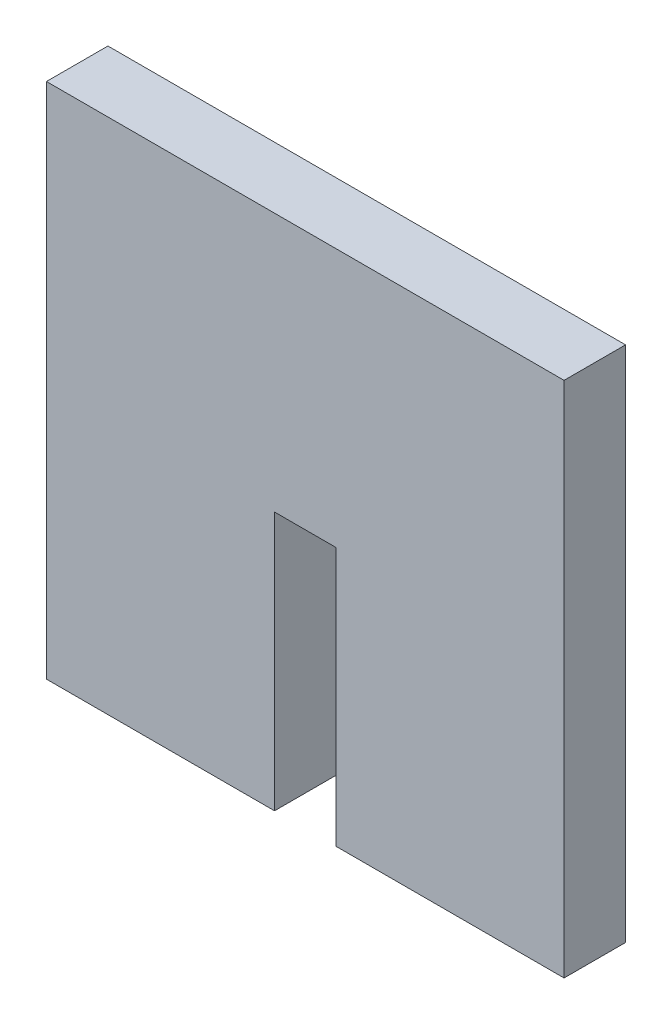
ISO-10303-21;
HEADER;
FILE_DESCRIPTION(('STEP AP214'),'2;1');
FILE_NAME('part.step','',(''),(''),'','','');
FILE_SCHEMA(('AUTOMOTIVE_DESIGN { 1 0 10303 214 1 1 1 1 }'));
ENDSEC;
DATA;
#1=APPLICATION_CONTEXT('core data for automotive mechanical design processes');
#2=APPLICATION_PROTOCOL_DEFINITION('international standard','automotive_design',2000,#1);
#3=PRODUCT_CONTEXT('',#1,'mechanical');
#4=PRODUCT('Part','Part','',(#3));
#5=PRODUCT_RELATED_PRODUCT_CATEGORY('part','',(#4));
#6=PRODUCT_DEFINITION_FORMATION('','',#4);
#7=PRODUCT_DEFINITION_CONTEXT('part definition',#1,'design');
#8=PRODUCT_DEFINITION('design','',#6,#7);
#9=PRODUCT_DEFINITION_SHAPE('','',#8);
#10=(LENGTH_UNIT() NAMED_UNIT(*) SI_UNIT(.MILLI.,.METRE.));
#11=(NAMED_UNIT(*) PLANE_ANGLE_UNIT() SI_UNIT($,.RADIAN.));
#12=(NAMED_UNIT(*) SI_UNIT($,.STERADIAN.) SOLID_ANGLE_UNIT());
#13=UNCERTAINTY_MEASURE_WITH_UNIT(LENGTH_MEASURE(1.E-05),#10,'distance_accuracy_value','');
#14=(GEOMETRIC_REPRESENTATION_CONTEXT(3) GLOBAL_UNCERTAINTY_ASSIGNED_CONTEXT((#13)) GLOBAL_UNIT_ASSIGNED_CONTEXT((#10,
#11,#12)) REPRESENTATION_CONTEXT('',''));
#15=CARTESIAN_POINT('',(0.,0.,0.));
#16=DIRECTION('',(0.,0.,1.));
#17=DIRECTION('',(1.,0.,0.));
#18=AXIS2_PLACEMENT_3D('',#15,#16,#17);
#19=CARTESIAN_POINT('',(0.,0.,4.318));
#20=DIRECTION('',(1.,0.,0.));
#21=DIRECTION('',(0.,0.,-1.));
#22=AXIS2_PLACEMENT_3D('',#19,#20,#21);
#23=PLANE('',#22);
#24=DIRECTION('',(0.,-1.,0.));
#25=VECTOR('',#24,1.);
#26=CARTESIAN_POINT('',(0.,0.,0.));
#27=LINE('',#26,#25);
#28=CARTESIAN_POINT('',(0.,36.36,0.));
#29=VERTEX_POINT('',#28);
#30=CARTESIAN_POINT('',(0.,0.,0.));
#31=VERTEX_POINT('',#30);
#32=EDGE_CURVE('E129',#29,#31,#27,.T.);
#33=ORIENTED_EDGE('',*,*,#32,.T.);
#34=DIRECTION('',(0.,0.,-1.));
#35=VECTOR('',#34,1.);
#36=CARTESIAN_POINT('',(0.,0.,4.318));
#37=LINE('',#36,#35);
#38=CARTESIAN_POINT('',(0.,0.,4.318));
#39=VERTEX_POINT('',#38);
#40=EDGE_CURVE('E11',#39,#31,#37,.T.);
#41=ORIENTED_EDGE('',*,*,#40,.F.);
#42=DIRECTION('',(0.,-1.,0.));
#43=VECTOR('',#42,1.);
#44=CARTESIAN_POINT('',(0.,0.,4.318));
#45=LINE('',#44,#43);
#46=CARTESIAN_POINT('',(0.,36.36,4.318));
#47=VERTEX_POINT('',#46);
#48=EDGE_CURVE('E143',#47,#39,#45,.T.);
#49=ORIENTED_EDGE('',*,*,#48,.F.);
#50=DIRECTION('',(0.,0.,-1.));
#51=VECTOR('',#50,1.);
#52=CARTESIAN_POINT('',(0.,36.36,4.318));
#53=LINE('',#52,#51);
#54=EDGE_CURVE('E125',#47,#29,#53,.T.);
#55=ORIENTED_EDGE('',*,*,#54,.T.);
#56=EDGE_LOOP('',(#33,#41,#49,#55));
#57=FACE_BOUND('',#56,.T.);
#58=ADVANCED_FACE('F33',(#57),#23,.F.);
#59=CARTESIAN_POINT('',(0.,0.,4.318));
#60=DIRECTION('',(0.,1.,0.));
#61=DIRECTION('',(0.,0.,1.));
#62=AXIS2_PLACEMENT_3D('',#59,#60,#61);
#63=PLANE('',#62);
#64=DIRECTION('',(1.,0.,0.));
#65=VECTOR('',#64,1.);
#66=CARTESIAN_POINT('',(0.,0.,0.));
#67=LINE('',#66,#65);
#68=CARTESIAN_POINT('',(16.021,0.,0.));
#69=VERTEX_POINT('',#68);
#70=EDGE_CURVE('E132',#31,#69,#67,.T.);
#71=ORIENTED_EDGE('',*,*,#70,.T.);
#72=DIRECTION('',(0.,0.,-1.));
#73=VECTOR('',#72,1.);
#74=CARTESIAN_POINT('',(16.021,0.,4.318));
#75=LINE('',#74,#73);
#76=CARTESIAN_POINT('',(16.021,0.,4.318));
#77=VERTEX_POINT('',#76);
#78=EDGE_CURVE('E41',#77,#69,#75,.T.);
#79=ORIENTED_EDGE('',*,*,#78,.F.);
#80=DIRECTION('',(1.,0.,0.));
#81=VECTOR('',#80,1.);
#82=CARTESIAN_POINT('',(0.,0.,4.318));
#83=LINE('',#82,#81);
#84=EDGE_CURVE('E92',#39,#77,#83,.T.);
#85=ORIENTED_EDGE('',*,*,#84,.F.);
#86=ORIENTED_EDGE('',*,*,#40,.T.);
#87=EDGE_LOOP('',(#71,#79,#85,#86));
#88=FACE_BOUND('',#87,.T.);
#89=ADVANCED_FACE('F178',(#88),#63,.F.);
#90=CARTESIAN_POINT('',(16.021,0.,4.318));
#91=DIRECTION('',(-1.,0.,0.));
#92=DIRECTION('',(0.,-1.,0.));
#93=AXIS2_PLACEMENT_3D('',#90,#91,#92);
#94=PLANE('',#93);
#95=DIRECTION('',(0.,1.,0.));
#96=VECTOR('',#95,1.);
#97=CARTESIAN_POINT('',(16.021,0.,0.));
#98=LINE('',#97,#96);
#99=CARTESIAN_POINT('',(16.021,18.18,0.));
#100=VERTEX_POINT('',#99);
#101=EDGE_CURVE('E134',#69,#100,#98,.T.);
#102=ORIENTED_EDGE('',*,*,#101,.T.);
#103=DIRECTION('',(0.,0.,-1.));
#104=VECTOR('',#103,1.);
#105=CARTESIAN_POINT('',(16.021,18.18,4.318));
#106=LINE('',#105,#104);
#107=CARTESIAN_POINT('',(16.021,18.18,4.318));
#108=VERTEX_POINT('',#107);
#109=EDGE_CURVE('E150',#108,#100,#106,.T.);
#110=ORIENTED_EDGE('',*,*,#109,.F.);
#111=DIRECTION('',(0.,1.,0.));
#112=VECTOR('',#111,1.);
#113=CARTESIAN_POINT('',(16.021,0.,4.318));
#114=LINE('',#113,#112);
#115=EDGE_CURVE('E158',#77,#108,#114,.T.);
#116=ORIENTED_EDGE('',*,*,#115,.F.);
#117=ORIENTED_EDGE('',*,*,#78,.T.);
#118=EDGE_LOOP('',(#102,#110,#116,#117));
#119=FACE_BOUND('',#118,.T.);
#120=ADVANCED_FACE('F156',(#119),#94,.F.);
#121=CARTESIAN_POINT('',(16.021,18.18,4.318));
#122=DIRECTION('',(0.,1.,0.));
#123=DIRECTION('',(0.,0.,1.));
#124=AXIS2_PLACEMENT_3D('',#121,#122,#123);
#125=PLANE('',#124);
#126=DIRECTION('',(1.,0.,0.));
#127=VECTOR('',#126,1.);
#128=CARTESIAN_POINT('',(16.021,18.18,0.));
#129=LINE('',#128,#127);
#130=CARTESIAN_POINT('',(20.339,18.18,0.));
#131=VERTEX_POINT('',#130);
#132=EDGE_CURVE('E136',#100,#131,#129,.T.);
#133=ORIENTED_EDGE('',*,*,#132,.T.);
#134=DIRECTION('',(0.,0.,-1.));
#135=VECTOR('',#134,1.);
#136=CARTESIAN_POINT('',(20.339,18.18,4.318));
#137=LINE('',#136,#135);
#138=CARTESIAN_POINT('',(20.339,18.18,4.318));
#139=VERTEX_POINT('',#138);
#140=EDGE_CURVE('E147',#139,#131,#137,.T.);
#141=ORIENTED_EDGE('',*,*,#140,.F.);
#142=DIRECTION('',(1.,0.,0.));
#143=VECTOR('',#142,1.);
#144=CARTESIAN_POINT('',(16.021,18.18,4.318));
#145=LINE('',#144,#143);
#146=EDGE_CURVE('E170',#108,#139,#145,.T.);
#147=ORIENTED_EDGE('',*,*,#146,.F.);
#148=ORIENTED_EDGE('',*,*,#109,.T.);
#149=EDGE_LOOP('',(#133,#141,#147,#148));
#150=FACE_BOUND('',#149,.T.);
#151=ADVANCED_FACE('F166',(#150),#125,.F.);
#152=CARTESIAN_POINT('',(20.339,0.,4.318));
#153=DIRECTION('',(1.,0.,0.));
#154=DIRECTION('',(0.,0.,-1.));
#155=AXIS2_PLACEMENT_3D('',#152,#153,#154);
#156=PLANE('',#155);
#157=DIRECTION('',(0.,-1.,0.));
#158=VECTOR('',#157,1.);
#159=CARTESIAN_POINT('',(20.339,0.,0.));
#160=LINE('',#159,#158);
#161=CARTESIAN_POINT('',(20.339,0.,0.));
#162=VERTEX_POINT('',#161);
#163=EDGE_CURVE('E138',#131,#162,#160,.T.);
#164=ORIENTED_EDGE('',*,*,#163,.T.);
#165=DIRECTION('',(0.,0.,-1.));
#166=VECTOR('',#165,1.);
#167=CARTESIAN_POINT('',(20.339,0.,4.318));
#168=LINE('',#167,#166);
#169=CARTESIAN_POINT('',(20.339,0.,4.318));
#170=VERTEX_POINT('',#169);
#171=EDGE_CURVE('E120',#170,#162,#168,.T.);
#172=ORIENTED_EDGE('',*,*,#171,.F.);
#173=DIRECTION('',(0.,-1.,0.));
#174=VECTOR('',#173,1.);
#175=CARTESIAN_POINT('',(20.339,0.,4.318));
#176=LINE('',#175,#174);
#177=EDGE_CURVE('E111',#139,#170,#176,.T.);
#178=ORIENTED_EDGE('',*,*,#177,.F.);
#179=ORIENTED_EDGE('',*,*,#140,.T.);
#180=EDGE_LOOP('',(#164,#172,#178,#179));
#181=FACE_BOUND('',#180,.T.);
#182=ADVANCED_FACE('F169',(#181),#156,.F.);
#183=CARTESIAN_POINT('',(20.339,0.,4.318));
#184=DIRECTION('',(0.,1.,0.));
#185=DIRECTION('',(0.,0.,1.));
#186=AXIS2_PLACEMENT_3D('',#183,#184,#185);
#187=PLANE('',#186);
#188=DIRECTION('',(1.,0.,0.));
#189=VECTOR('',#188,1.);
#190=CARTESIAN_POINT('',(20.339,0.,0.));
#191=LINE('',#190,#189);
#192=CARTESIAN_POINT('',(36.36,0.,0.));
#193=VERTEX_POINT('',#192);
#194=EDGE_CURVE('E119',#162,#193,#191,.T.);
#195=ORIENTED_EDGE('',*,*,#194,.T.);
#196=DIRECTION('',(0.,0.,-1.));
#197=VECTOR('',#196,1.);
#198=CARTESIAN_POINT('',(36.36,0.,4.318));
#199=LINE('',#198,#197);
#200=CARTESIAN_POINT('',(36.36,0.,4.318));
#201=VERTEX_POINT('',#200);
#202=EDGE_CURVE('E116',#201,#193,#199,.T.);
#203=ORIENTED_EDGE('',*,*,#202,.F.);
#204=DIRECTION('',(1.,0.,0.));
#205=VECTOR('',#204,1.);
#206=CARTESIAN_POINT('',(20.339,0.,4.318));
#207=LINE('',#206,#205);
#208=EDGE_CURVE('E105',#170,#201,#207,.T.);
#209=ORIENTED_EDGE('',*,*,#208,.F.);
#210=ORIENTED_EDGE('',*,*,#171,.T.);
#211=EDGE_LOOP('',(#195,#203,#209,#210));
#212=FACE_BOUND('',#211,.T.);
#213=ADVANCED_FACE('F117',(#212),#187,.F.);
#214=CARTESIAN_POINT('',(36.36,0.,4.318));
#215=DIRECTION('',(-1.,0.,0.));
#216=DIRECTION('',(0.,0.,1.));
#217=AXIS2_PLACEMENT_3D('',#214,#215,#216);
#218=PLANE('',#217);
#219=DIRECTION('',(0.,1.,0.));
#220=VECTOR('',#219,1.);
#221=CARTESIAN_POINT('',(36.36,0.,0.));
#222=LINE('',#221,#220);
#223=CARTESIAN_POINT('',(36.36,36.36,0.));
#224=VERTEX_POINT('',#223);
#225=EDGE_CURVE('E78',#193,#224,#222,.T.);
#226=ORIENTED_EDGE('',*,*,#225,.T.);
#227=DIRECTION('',(0.,0.,-1.));
#228=VECTOR('',#227,1.);
#229=CARTESIAN_POINT('',(36.36,36.36,4.318));
#230=LINE('',#229,#228);
#231=CARTESIAN_POINT('',(36.36,36.36,4.318));
#232=VERTEX_POINT('',#231);
#233=EDGE_CURVE('E121',#232,#224,#230,.T.);
#234=ORIENTED_EDGE('',*,*,#233,.F.);
#235=DIRECTION('',(0.,1.,0.));
#236=VECTOR('',#235,1.);
#237=CARTESIAN_POINT('',(36.36,0.,4.318));
#238=LINE('',#237,#236);
#239=EDGE_CURVE('E109',#201,#232,#238,.T.);
#240=ORIENTED_EDGE('',*,*,#239,.F.);
#241=ORIENTED_EDGE('',*,*,#202,.T.);
#242=EDGE_LOOP('',(#226,#234,#240,#241));
#243=FACE_BOUND('',#242,.T.);
#244=ADVANCED_FACE('F123',(#243),#218,.F.);
#245=CARTESIAN_POINT('',(0.,36.36,4.318));
#246=DIRECTION('',(0.,-1.,0.));
#247=DIRECTION('',(0.,0.,-1.));
#248=AXIS2_PLACEMENT_3D('',#245,#246,#247);
#249=PLANE('',#248);
#250=DIRECTION('',(-1.,0.,0.));
#251=VECTOR('',#250,1.);
#252=CARTESIAN_POINT('',(0.,36.36,0.));
#253=LINE('',#252,#251);
#254=EDGE_CURVE('E84',#224,#29,#253,.T.);
#255=ORIENTED_EDGE('',*,*,#254,.T.);
#256=ORIENTED_EDGE('',*,*,#54,.F.);
#257=DIRECTION('',(-1.,0.,0.));
#258=VECTOR('',#257,1.);
#259=CARTESIAN_POINT('',(0.,36.36,4.318));
#260=LINE('',#259,#258);
#261=EDGE_CURVE('E49',#232,#47,#260,.T.);
#262=ORIENTED_EDGE('',*,*,#261,.F.);
#263=ORIENTED_EDGE('',*,*,#233,.T.);
#264=EDGE_LOOP('',(#255,#256,#262,#263));
#265=FACE_BOUND('',#264,.T.);
#266=ADVANCED_FACE('F194',(#265),#249,.F.);
#267=CARTESIAN_POINT('',(0.,36.36,4.318));
#268=DIRECTION('',(0.,0.,-1.));
#269=DIRECTION('',(-1.,0.,0.));
#270=AXIS2_PLACEMENT_3D('',#267,#268,#269);
#271=PLANE('',#270);
#272=ORIENTED_EDGE('',*,*,#48,.T.);
#273=ORIENTED_EDGE('',*,*,#84,.T.);
#274=ORIENTED_EDGE('',*,*,#115,.T.);
#275=ORIENTED_EDGE('',*,*,#146,.T.);
#276=ORIENTED_EDGE('',*,*,#177,.T.);
#277=ORIENTED_EDGE('',*,*,#208,.T.);
#278=ORIENTED_EDGE('',*,*,#239,.T.);
#279=ORIENTED_EDGE('',*,*,#261,.T.);
#280=EDGE_LOOP('',(#272,#273,#274,#275,#276,#277,#278,#279));
#281=FACE_BOUND('',#280,.T.);
#282=ADVANCED_FACE('F107',(#281),#271,.F.);
#283=CARTESIAN_POINT('',(0.,36.36,0.));
#284=DIRECTION('',(0.,0.,-1.));
#285=DIRECTION('',(-1.,0.,0.));
#286=AXIS2_PLACEMENT_3D('',#283,#284,#285);
#287=PLANE('',#286);
#288=ORIENTED_EDGE('',*,*,#32,.F.);
#289=ORIENTED_EDGE('',*,*,#254,.F.);
#290=ORIENTED_EDGE('',*,*,#225,.F.);
#291=ORIENTED_EDGE('',*,*,#194,.F.);
#292=ORIENTED_EDGE('',*,*,#163,.F.);
#293=ORIENTED_EDGE('',*,*,#132,.F.);
#294=ORIENTED_EDGE('',*,*,#101,.F.);
#295=ORIENTED_EDGE('',*,*,#70,.F.);
#296=EDGE_LOOP('',(#288,#289,#290,#291,#292,#293,#294,#295));
#297=FACE_BOUND('',#296,.T.);
#298=ADVANCED_FACE('F162',(#297),#287,.T.);
#299=CLOSED_SHELL('',(#58,#89,#120,#151,#182,#213,#244,#266,#282,#298));
#300=MANIFOLD_SOLID_BREP('B2',#299);
#301=ADVANCED_BREP_SHAPE_REPRESENTATION('',(#18,#300),#14);
#302=SHAPE_DEFINITION_REPRESENTATION(#9,#301);
ENDSEC;
END-ISO-10303-21;
